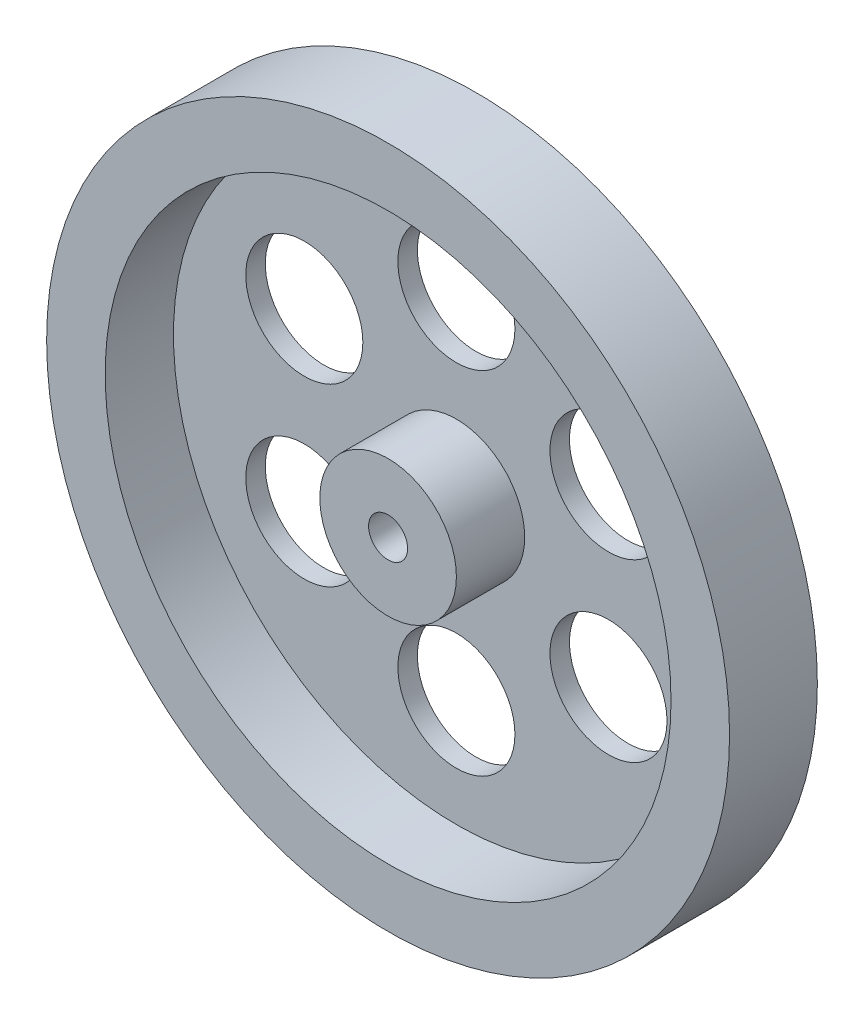
ISO-10303-21;
HEADER;
FILE_DESCRIPTION(('STEP AP214'),'2;1');
FILE_NAME('part.step','',(''),(''),'','','');
FILE_SCHEMA(('AUTOMOTIVE_DESIGN { 1 0 10303 214 1 1 1 1 }'));
ENDSEC;
DATA;
#1=APPLICATION_CONTEXT('core data for automotive mechanical design processes');
#2=APPLICATION_PROTOCOL_DEFINITION('international standard','automotive_design',2000,#1);
#3=PRODUCT_CONTEXT('',#1,'mechanical');
#4=PRODUCT('Part','Part','',(#3));
#5=PRODUCT_RELATED_PRODUCT_CATEGORY('part','',(#4));
#6=PRODUCT_DEFINITION_FORMATION('','',#4);
#7=PRODUCT_DEFINITION_CONTEXT('part definition',#1,'design');
#8=PRODUCT_DEFINITION('design','',#6,#7);
#9=PRODUCT_DEFINITION_SHAPE('','',#8);
#10=(LENGTH_UNIT() NAMED_UNIT(*) SI_UNIT(.MILLI.,.METRE.));
#11=(NAMED_UNIT(*) PLANE_ANGLE_UNIT() SI_UNIT($,.RADIAN.));
#12=(NAMED_UNIT(*) SI_UNIT($,.STERADIAN.) SOLID_ANGLE_UNIT());
#13=UNCERTAINTY_MEASURE_WITH_UNIT(LENGTH_MEASURE(1.E-05),#10,'distance_accuracy_value','');
#14=(GEOMETRIC_REPRESENTATION_CONTEXT(3) GLOBAL_UNCERTAINTY_ASSIGNED_CONTEXT((#13)) GLOBAL_UNIT_ASSIGNED_CONTEXT((#10,
#11,#12)) REPRESENTATION_CONTEXT('',''));
#15=CARTESIAN_POINT('',(0.,0.,0.));
#16=DIRECTION('',(0.,0.,1.));
#17=DIRECTION('',(1.,0.,0.));
#18=AXIS2_PLACEMENT_3D('',#15,#16,#17);
#19=CARTESIAN_POINT('',(0.,0.,9.));
#20=DIRECTION('',(0.,0.,1.));
#21=DIRECTION('',(1.,0.,0.));
#22=AXIS2_PLACEMENT_3D('',#19,#20,#21);
#23=PLANE('',#22);
#24=CARTESIAN_POINT('',(0.,0.,9.));
#25=DIRECTION('',(0.,0.,1.));
#26=DIRECTION('',(1.,0.,0.));
#27=AXIS2_PLACEMENT_3D('',#24,#25,#26);
#28=CIRCLE('',#27,2.);
#29=CARTESIAN_POINT('',(2.,0.,9.));
#30=VERTEX_POINT('',#29);
#31=EDGE_CURVE('E45',#30,#30,#28,.T.);
#32=ORIENTED_EDGE('',*,*,#31,.F.);
#33=EDGE_LOOP('',(#32));
#34=FACE_BOUND('',#33,.T.);
#35=CARTESIAN_POINT('',(0.,0.,9.));
#36=DIRECTION('',(0.,0.,1.));
#37=DIRECTION('',(1.,0.,0.));
#38=AXIS2_PLACEMENT_3D('',#35,#36,#37);
#39=CIRCLE('',#38,7.);
#40=CARTESIAN_POINT('',(7.,0.,9.));
#41=VERTEX_POINT('',#40);
#42=EDGE_CURVE('E59',#41,#41,#39,.T.);
#43=ORIENTED_EDGE('',*,*,#42,.T.);
#44=EDGE_LOOP('',(#43));
#45=FACE_BOUND('',#44,.T.);
#46=ADVANCED_FACE('F34',(#34,#45),#23,.T.);
#47=CARTESIAN_POINT('',(0.,0.,9.));
#48=DIRECTION('',(0.,0.,-1.));
#49=DIRECTION('',(-1.,0.,0.));
#50=AXIS2_PLACEMENT_3D('',#47,#48,#49);
#51=CYLINDRICAL_SURFACE('',#50,35.);
#52=CARTESIAN_POINT('',(0.,0.,9.));
#53=DIRECTION('',(0.,0.,1.));
#54=DIRECTION('',(1.,0.,0.));
#55=AXIS2_PLACEMENT_3D('',#52,#53,#54);
#56=CIRCLE('',#55,35.);
#57=CARTESIAN_POINT('',(35.,0.,9.));
#58=VERTEX_POINT('',#57);
#59=EDGE_CURVE('E10',#58,#58,#56,.T.);
#60=ORIENTED_EDGE('',*,*,#59,.F.);
#61=EDGE_LOOP('',(#60));
#62=FACE_BOUND('',#61,.T.);
#63=CARTESIAN_POINT('',(0.,0.,0.));
#64=DIRECTION('',(0.,0.,1.));
#65=DIRECTION('',(1.,0.,0.));
#66=AXIS2_PLACEMENT_3D('',#63,#64,#65);
#67=CIRCLE('',#66,35.);
#68=CARTESIAN_POINT('',(35.,0.,0.));
#69=VERTEX_POINT('',#68);
#70=EDGE_CURVE('E38',#69,#69,#67,.T.);
#71=ORIENTED_EDGE('',*,*,#70,.T.);
#72=EDGE_LOOP('',(#71));
#73=FACE_BOUND('',#72,.T.);
#74=ADVANCED_FACE('F36',(#62,#73),#51,.T.);
#75=CARTESIAN_POINT('',(0.,0.,9.));
#76=DIRECTION('',(0.,0.,1.));
#77=DIRECTION('',(1.,0.,0.));
#78=AXIS2_PLACEMENT_3D('',#75,#76,#77);
#79=CIRCLE('',#78,29.);
#80=CARTESIAN_POINT('',(29.,0.,9.));
#81=VERTEX_POINT('',#80);
#82=EDGE_CURVE('E53',#81,#81,#79,.T.);
#83=ORIENTED_EDGE('',*,*,#82,.F.);
#84=EDGE_LOOP('',(#83));
#85=FACE_BOUND('',#84,.T.);
#86=ORIENTED_EDGE('',*,*,#59,.T.);
#87=EDGE_LOOP('',(#86));
#88=FACE_BOUND('',#87,.T.);
#89=ADVANCED_FACE('F131',(#85,#88),#23,.T.);
#90=CARTESIAN_POINT('',(0.,0.,0.));
#91=DIRECTION('',(0.,0.,1.));
#92=DIRECTION('',(1.,0.,0.));
#93=AXIS2_PLACEMENT_3D('',#90,#91,#92);
#94=PLANE('',#93);
#95=CARTESIAN_POINT('',(15.5884572681201,9.00000000000044,0.));
#96=DIRECTION('',(0.,0.,1.));
#97=DIRECTION('',(1.,0.,0.));
#98=AXIS2_PLACEMENT_3D('',#95,#96,#97);
#99=CIRCLE('',#98,6.00000000000016);
#100=CARTESIAN_POINT('',(21.5884572681203,9.00000000000044,0.));
#101=VERTEX_POINT('',#100);
#102=EDGE_CURVE('E68',#101,#101,#99,.T.);
#103=ORIENTED_EDGE('',*,*,#102,.T.);
#104=EDGE_LOOP('',(#103));
#105=FACE_BOUND('',#104,.T.);
#106=CARTESIAN_POINT('',(15.5884572681207,-8.99999999999956,0.));
#107=DIRECTION('',(0.,0.,1.));
#108=DIRECTION('',(1.,0.,0.));
#109=AXIS2_PLACEMENT_3D('',#106,#107,#108);
#110=CIRCLE('',#109,6.00000000000069);
#111=CARTESIAN_POINT('',(21.5884572681213,-8.99999999999956,0.));
#112=VERTEX_POINT('',#111);
#113=EDGE_CURVE('E87',#112,#112,#110,.T.);
#114=ORIENTED_EDGE('',*,*,#113,.T.);
#115=EDGE_LOOP('',(#114));
#116=FACE_BOUND('',#115,.T.);
#117=CARTESIAN_POINT('',(1.01656844677915E-12,-18.,0.));
#118=DIRECTION('',(0.,0.,1.));
#119=DIRECTION('',(1.,0.,0.));
#120=AXIS2_PLACEMENT_3D('',#117,#118,#119);
#121=CIRCLE('',#120,6.00000000000109);
#122=CARTESIAN_POINT('',(6.00000000000211,-18.,0.));
#123=VERTEX_POINT('',#122);
#124=EDGE_CURVE('E81',#123,#123,#121,.T.);
#125=ORIENTED_EDGE('',*,*,#124,.T.);
#126=EDGE_LOOP('',(#125));
#127=FACE_BOUND('',#126,.T.);
#128=CARTESIAN_POINT('',(-15.5884572681191,-9.00000000000045,0.));
#129=DIRECTION('',(0.,0.,1.));
#130=DIRECTION('',(1.,0.,0.));
#131=AXIS2_PLACEMENT_3D('',#128,#129,#130);
#132=CIRCLE('',#131,6.00000000000103);
#133=CARTESIAN_POINT('',(-9.5884572681181,-9.00000000000045,0.));
#134=VERTEX_POINT('',#133);
#135=EDGE_CURVE('E74',#134,#134,#132,.T.);
#136=ORIENTED_EDGE('',*,*,#135,.T.);
#137=EDGE_LOOP('',(#136));
#138=FACE_BOUND('',#137,.T.);
#139=CARTESIAN_POINT('',(-15.5884572681196,8.99999999999955,0.));
#140=DIRECTION('',(0.,0.,1.));
#141=DIRECTION('',(1.,0.,0.));
#142=AXIS2_PLACEMENT_3D('',#139,#140,#141);
#143=CIRCLE('',#142,6.00000000000059);
#144=CARTESIAN_POINT('',(-9.58845726811906,8.99999999999955,0.));
#145=VERTEX_POINT('',#144);
#146=EDGE_CURVE('E75',#145,#145,#143,.T.);
#147=ORIENTED_EDGE('',*,*,#146,.T.);
#148=EDGE_LOOP('',(#147));
#149=FACE_BOUND('',#148,.T.);
#150=CARTESIAN_POINT('',(0.,18.,0.));
#151=DIRECTION('',(0.,0.,1.));
#152=DIRECTION('',(1.,0.,0.));
#153=AXIS2_PLACEMENT_3D('',#150,#151,#152);
#154=CIRCLE('',#153,6.);
#155=CARTESIAN_POINT('',(6.,18.,0.));
#156=VERTEX_POINT('',#155);
#157=EDGE_CURVE('E62',#156,#156,#154,.T.);
#158=ORIENTED_EDGE('',*,*,#157,.T.);
#159=EDGE_LOOP('',(#158));
#160=FACE_BOUND('',#159,.T.);
#161=CARTESIAN_POINT('',(0.,0.,0.));
#162=DIRECTION('',(0.,0.,1.));
#163=DIRECTION('',(1.,0.,0.));
#164=AXIS2_PLACEMENT_3D('',#161,#162,#163);
#165=CIRCLE('',#164,2.);
#166=CARTESIAN_POINT('',(2.,0.,0.));
#167=VERTEX_POINT('',#166);
#168=EDGE_CURVE('E49',#167,#167,#165,.T.);
#169=ORIENTED_EDGE('',*,*,#168,.T.);
#170=EDGE_LOOP('',(#169));
#171=FACE_BOUND('',#170,.T.);
#172=ORIENTED_EDGE('',*,*,#70,.F.);
#173=EDGE_LOOP('',(#172));
#174=FACE_BOUND('',#173,.T.);
#175=ADVANCED_FACE('F101',(#105,#116,#127,#138,#149,#160,#171,#174),#94,.F.);
#176=CARTESIAN_POINT('',(0.,0.,0.));
#177=DIRECTION('',(0.,0.,1.));
#178=DIRECTION('',(1.,0.,0.));
#179=AXIS2_PLACEMENT_3D('',#176,#177,#178);
#180=CYLINDRICAL_SURFACE('',#179,2.);
#181=ORIENTED_EDGE('',*,*,#31,.T.);
#182=EDGE_LOOP('',(#181));
#183=FACE_BOUND('',#182,.T.);
#184=ORIENTED_EDGE('',*,*,#168,.F.);
#185=EDGE_LOOP('',(#184));
#186=FACE_BOUND('',#185,.T.);
#187=ADVANCED_FACE('F127',(#183,#186),#180,.F.);
#188=CARTESIAN_POINT('',(0.,0.,2.));
#189=DIRECTION('',(0.,0.,1.));
#190=DIRECTION('',(1.,0.,0.));
#191=AXIS2_PLACEMENT_3D('',#188,#189,#190);
#192=CYLINDRICAL_SURFACE('',#191,29.);
#193=CARTESIAN_POINT('',(0.,0.,2.));
#194=DIRECTION('',(0.,0.,1.));
#195=DIRECTION('',(1.,0.,0.));
#196=AXIS2_PLACEMENT_3D('',#193,#194,#195);
#197=CIRCLE('',#196,29.);
#198=CARTESIAN_POINT('',(29.,0.,2.));
#199=VERTEX_POINT('',#198);
#200=EDGE_CURVE('E52',#199,#199,#197,.T.);
#201=ORIENTED_EDGE('',*,*,#200,.F.);
#202=EDGE_LOOP('',(#201));
#203=FACE_BOUND('',#202,.T.);
#204=ORIENTED_EDGE('',*,*,#82,.T.);
#205=EDGE_LOOP('',(#204));
#206=FACE_BOUND('',#205,.T.);
#207=ADVANCED_FACE('F116',(#203,#206),#192,.F.);
#208=CARTESIAN_POINT('',(0.,0.,2.));
#209=DIRECTION('',(0.,0.,1.));
#210=DIRECTION('',(1.,0.,0.));
#211=AXIS2_PLACEMENT_3D('',#208,#209,#210);
#212=PLANE('',#211);
#213=CARTESIAN_POINT('',(-15.5884572681191,-9.00000000000045,2.));
#214=DIRECTION('',(0.,0.,1.));
#215=DIRECTION('',(1.,0.,0.));
#216=AXIS2_PLACEMENT_3D('',#213,#214,#215);
#217=CIRCLE('',#216,6.00000000000103);
#218=CARTESIAN_POINT('',(-9.5884572681181,-9.00000000000045,2.));
#219=VERTEX_POINT('',#218);
#220=EDGE_CURVE('E71',#219,#219,#217,.T.);
#221=ORIENTED_EDGE('',*,*,#220,.F.);
#222=EDGE_LOOP('',(#221));
#223=FACE_BOUND('',#222,.T.);
#224=CARTESIAN_POINT('',(15.5884572681201,9.00000000000044,2.));
#225=DIRECTION('',(0.,0.,1.));
#226=DIRECTION('',(1.,0.,0.));
#227=AXIS2_PLACEMENT_3D('',#224,#225,#226);
#228=CIRCLE('',#227,6.00000000000016);
#229=CARTESIAN_POINT('',(21.5884572681203,9.00000000000044,2.));
#230=VERTEX_POINT('',#229);
#231=EDGE_CURVE('E90',#230,#230,#228,.T.);
#232=ORIENTED_EDGE('',*,*,#231,.F.);
#233=EDGE_LOOP('',(#232));
#234=FACE_BOUND('',#233,.T.);
#235=CARTESIAN_POINT('',(15.5884572681207,-8.99999999999956,2.));
#236=DIRECTION('',(0.,0.,1.));
#237=DIRECTION('',(1.,0.,0.));
#238=AXIS2_PLACEMENT_3D('',#235,#236,#237);
#239=CIRCLE('',#238,6.00000000000069);
#240=CARTESIAN_POINT('',(21.5884572681213,-8.99999999999956,2.));
#241=VERTEX_POINT('',#240);
#242=EDGE_CURVE('E84',#241,#241,#239,.T.);
#243=ORIENTED_EDGE('',*,*,#242,.F.);
#244=EDGE_LOOP('',(#243));
#245=FACE_BOUND('',#244,.T.);
#246=CARTESIAN_POINT('',(1.01656844677915E-12,-18.,2.));
#247=DIRECTION('',(0.,0.,1.));
#248=DIRECTION('',(1.,0.,0.));
#249=AXIS2_PLACEMENT_3D('',#246,#247,#248);
#250=CIRCLE('',#249,6.00000000000109);
#251=CARTESIAN_POINT('',(6.00000000000211,-18.,2.));
#252=VERTEX_POINT('',#251);
#253=EDGE_CURVE('E78',#252,#252,#250,.T.);
#254=ORIENTED_EDGE('',*,*,#253,.F.);
#255=EDGE_LOOP('',(#254));
#256=FACE_BOUND('',#255,.T.);
#257=CARTESIAN_POINT('',(-15.5884572681196,8.99999999999955,2.));
#258=DIRECTION('',(0.,0.,1.));
#259=DIRECTION('',(1.,0.,0.));
#260=AXIS2_PLACEMENT_3D('',#257,#258,#259);
#261=CIRCLE('',#260,6.00000000000059);
#262=CARTESIAN_POINT('',(-9.58845726811906,8.99999999999955,2.));
#263=VERTEX_POINT('',#262);
#264=EDGE_CURVE('E95',#263,#263,#261,.T.);
#265=ORIENTED_EDGE('',*,*,#264,.F.);
#266=EDGE_LOOP('',(#265));
#267=FACE_BOUND('',#266,.T.);
#268=CARTESIAN_POINT('',(0.,18.,2.));
#269=DIRECTION('',(0.,0.,1.));
#270=DIRECTION('',(1.,0.,0.));
#271=AXIS2_PLACEMENT_3D('',#268,#269,#270);
#272=CIRCLE('',#271,6.);
#273=CARTESIAN_POINT('',(6.,18.,2.));
#274=VERTEX_POINT('',#273);
#275=EDGE_CURVE('E65',#274,#274,#272,.T.);
#276=ORIENTED_EDGE('',*,*,#275,.F.);
#277=EDGE_LOOP('',(#276));
#278=FACE_BOUND('',#277,.T.);
#279=CARTESIAN_POINT('',(0.,0.,2.));
#280=DIRECTION('',(0.,0.,1.));
#281=DIRECTION('',(1.,0.,0.));
#282=AXIS2_PLACEMENT_3D('',#279,#280,#281);
#283=CIRCLE('',#282,7.);
#284=CARTESIAN_POINT('',(7.,0.,2.));
#285=VERTEX_POINT('',#284);
#286=EDGE_CURVE('E56',#285,#285,#283,.T.);
#287=ORIENTED_EDGE('',*,*,#286,.F.);
#288=EDGE_LOOP('',(#287));
#289=FACE_BOUND('',#288,.T.);
#290=ORIENTED_EDGE('',*,*,#200,.T.);
#291=EDGE_LOOP('',(#290));
#292=FACE_BOUND('',#291,.T.);
#293=ADVANCED_FACE('F112',(#223,#234,#245,#256,#267,#278,#289,#292),#212,.T.);
#294=CARTESIAN_POINT('',(0.,0.,2.));
#295=DIRECTION('',(0.,0.,1.));
#296=DIRECTION('',(1.,0.,0.));
#297=AXIS2_PLACEMENT_3D('',#294,#295,#296);
#298=CYLINDRICAL_SURFACE('',#297,7.);
#299=ORIENTED_EDGE('',*,*,#286,.T.);
#300=EDGE_LOOP('',(#299));
#301=FACE_BOUND('',#300,.T.);
#302=ORIENTED_EDGE('',*,*,#42,.F.);
#303=EDGE_LOOP('',(#302));
#304=FACE_BOUND('',#303,.T.);
#305=ADVANCED_FACE('F115',(#301,#304),#298,.T.);
#306=CARTESIAN_POINT('',(0.,18.,0.));
#307=DIRECTION('',(0.,0.,1.));
#308=DIRECTION('',(1.,0.,0.));
#309=AXIS2_PLACEMENT_3D('',#306,#307,#308);
#310=CYLINDRICAL_SURFACE('',#309,6.);
#311=ORIENTED_EDGE('',*,*,#157,.F.);
#312=EDGE_LOOP('',(#311));
#313=FACE_BOUND('',#312,.T.);
#314=ORIENTED_EDGE('',*,*,#275,.T.);
#315=EDGE_LOOP('',(#314));
#316=FACE_BOUND('',#315,.T.);
#317=ADVANCED_FACE('F108',(#313,#316),#310,.F.);
#318=CARTESIAN_POINT('',(-15.5884572681196,8.99999999999955,0.));
#319=DIRECTION('',(0.,0.,1.));
#320=DIRECTION('',(1.,0.,0.));
#321=AXIS2_PLACEMENT_3D('',#318,#319,#320);
#322=CYLINDRICAL_SURFACE('',#321,6.00000000000059);
#323=ORIENTED_EDGE('',*,*,#146,.F.);
#324=EDGE_LOOP('',(#323));
#325=FACE_BOUND('',#324,.T.);
#326=ORIENTED_EDGE('',*,*,#264,.T.);
#327=EDGE_LOOP('',(#326));
#328=FACE_BOUND('',#327,.T.);
#329=ADVANCED_FACE('F104',(#325,#328),#322,.F.);
#330=CARTESIAN_POINT('',(1.01656844677915E-12,-18.,0.));
#331=DIRECTION('',(0.,0.,1.));
#332=DIRECTION('',(1.,0.,0.));
#333=AXIS2_PLACEMENT_3D('',#330,#331,#332);
#334=CYLINDRICAL_SURFACE('',#333,6.00000000000109);
#335=ORIENTED_EDGE('',*,*,#124,.F.);
#336=EDGE_LOOP('',(#335));
#337=FACE_BOUND('',#336,.T.);
#338=ORIENTED_EDGE('',*,*,#253,.T.);
#339=EDGE_LOOP('',(#338));
#340=FACE_BOUND('',#339,.T.);
#341=ADVANCED_FACE('F107',(#337,#340),#334,.F.);
#342=CARTESIAN_POINT('',(15.5884572681207,-8.99999999999956,0.));
#343=DIRECTION('',(0.,0.,1.));
#344=DIRECTION('',(1.,0.,0.));
#345=AXIS2_PLACEMENT_3D('',#342,#343,#344);
#346=CYLINDRICAL_SURFACE('',#345,6.00000000000069);
#347=ORIENTED_EDGE('',*,*,#113,.F.);
#348=EDGE_LOOP('',(#347));
#349=FACE_BOUND('',#348,.T.);
#350=ORIENTED_EDGE('',*,*,#242,.T.);
#351=EDGE_LOOP('',(#350));
#352=FACE_BOUND('',#351,.T.);
#353=ADVANCED_FACE('F203',(#349,#352),#346,.F.);
#354=CARTESIAN_POINT('',(15.5884572681201,9.00000000000044,0.));
#355=DIRECTION('',(0.,0.,1.));
#356=DIRECTION('',(1.,0.,0.));
#357=AXIS2_PLACEMENT_3D('',#354,#355,#356);
#358=CYLINDRICAL_SURFACE('',#357,6.00000000000016);
#359=ORIENTED_EDGE('',*,*,#102,.F.);
#360=EDGE_LOOP('',(#359));
#361=FACE_BOUND('',#360,.T.);
#362=ORIENTED_EDGE('',*,*,#231,.T.);
#363=EDGE_LOOP('',(#362));
#364=FACE_BOUND('',#363,.T.);
#365=ADVANCED_FACE('F213',(#361,#364),#358,.F.);
#366=CARTESIAN_POINT('',(-15.5884572681191,-9.00000000000045,0.));
#367=DIRECTION('',(0.,0.,1.));
#368=DIRECTION('',(1.,0.,0.));
#369=AXIS2_PLACEMENT_3D('',#366,#367,#368);
#370=CYLINDRICAL_SURFACE('',#369,6.00000000000103);
#371=ORIENTED_EDGE('',*,*,#135,.F.);
#372=EDGE_LOOP('',(#371));
#373=FACE_BOUND('',#372,.T.);
#374=ORIENTED_EDGE('',*,*,#220,.T.);
#375=EDGE_LOOP('',(#374));
#376=FACE_BOUND('',#375,.T.);
#377=ADVANCED_FACE('F223',(#373,#376),#370,.F.);
#378=CLOSED_SHELL('',(#46,#74,#89,#175,#187,#207,#293,#305,#317,#329,#341,#353,#365,#377));
#379=MANIFOLD_SOLID_BREP('B2',#378);
#380=ADVANCED_BREP_SHAPE_REPRESENTATION('',(#18,#379),#14);
#381=SHAPE_DEFINITION_REPRESENTATION(#9,#380);
ENDSEC;
END-ISO-10303-21;
